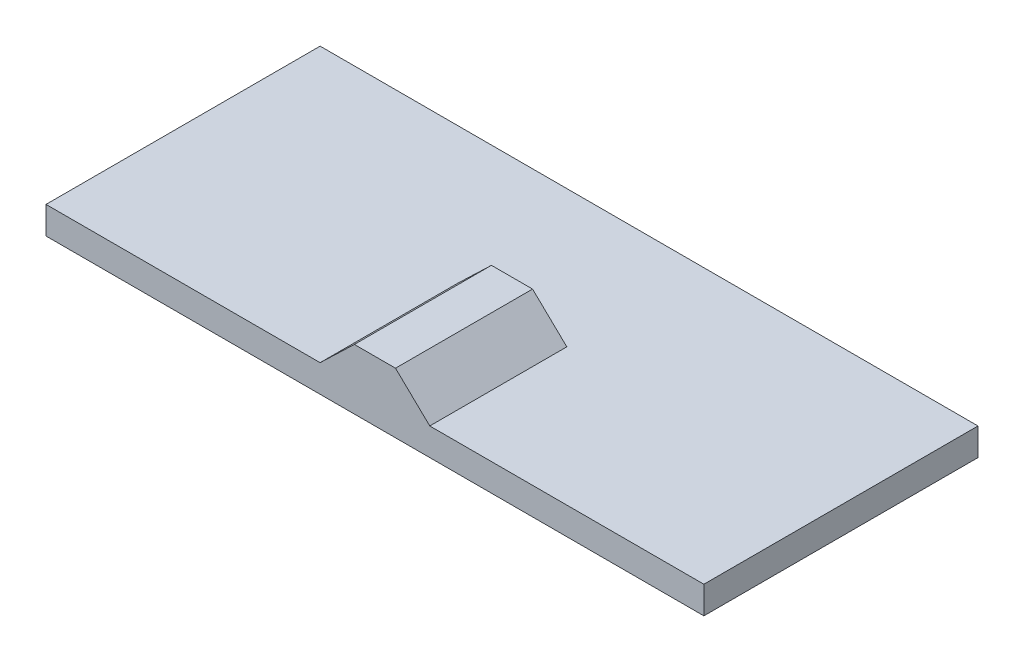
ISO-10303-21;
HEADER;
FILE_DESCRIPTION(('STEP AP214'),'2;1');
FILE_NAME('part.step','',(''),(''),'','','');
FILE_SCHEMA(('AUTOMOTIVE_DESIGN { 1 0 10303 214 1 1 1 1 }'));
ENDSEC;
DATA;
#1=APPLICATION_CONTEXT('core data for automotive mechanical design processes');
#2=APPLICATION_PROTOCOL_DEFINITION('international standard','automotive_design',2000,#1);
#3=PRODUCT_CONTEXT('',#1,'mechanical');
#4=PRODUCT('Part','Part','',(#3));
#5=PRODUCT_RELATED_PRODUCT_CATEGORY('part','',(#4));
#6=PRODUCT_DEFINITION_FORMATION('','',#4);
#7=PRODUCT_DEFINITION_CONTEXT('part definition',#1,'design');
#8=PRODUCT_DEFINITION('design','',#6,#7);
#9=PRODUCT_DEFINITION_SHAPE('','',#8);
#10=(LENGTH_UNIT() NAMED_UNIT(*) SI_UNIT(.MILLI.,.METRE.));
#11=(NAMED_UNIT(*) PLANE_ANGLE_UNIT() SI_UNIT($,.RADIAN.));
#12=(NAMED_UNIT(*) SI_UNIT($,.STERADIAN.) SOLID_ANGLE_UNIT());
#13=UNCERTAINTY_MEASURE_WITH_UNIT(LENGTH_MEASURE(1.E-05),#10,'distance_accuracy_value','');
#14=(GEOMETRIC_REPRESENTATION_CONTEXT(3) GLOBAL_UNCERTAINTY_ASSIGNED_CONTEXT((#13)) GLOBAL_UNIT_ASSIGNED_CONTEXT((#10,
#11,#12)) REPRESENTATION_CONTEXT('',''));
#15=CARTESIAN_POINT('',(0.,0.,0.));
#16=DIRECTION('',(0.,0.,1.));
#17=DIRECTION('',(1.,0.,0.));
#18=AXIS2_PLACEMENT_3D('',#15,#16,#17);
#19=CARTESIAN_POINT('',(-1800.,150.,750.));
#20=DIRECTION('',(1.,0.,0.));
#21=DIRECTION('',(0.,0.,-1.));
#22=AXIS2_PLACEMENT_3D('',#19,#20,#21);
#23=PLANE('',#22);
#24=DIRECTION('',(0.,0.,1.));
#25=VECTOR('',#24,1.);
#26=CARTESIAN_POINT('',(-1800.,0.,750.));
#27=LINE('',#26,#25);
#28=CARTESIAN_POINT('',(-1800.,0.,-750.));
#29=VERTEX_POINT('',#28);
#30=CARTESIAN_POINT('',(-1800.,0.,750.));
#31=VERTEX_POINT('',#30);
#32=EDGE_CURVE('E158',#29,#31,#27,.T.);
#33=ORIENTED_EDGE('',*,*,#32,.T.);
#34=DIRECTION('',(0.,-1.,0.));
#35=VECTOR('',#34,1.);
#36=CARTESIAN_POINT('',(-1800.,150.,750.));
#37=LINE('',#36,#35);
#38=CARTESIAN_POINT('',(-1800.,150.,750.));
#39=VERTEX_POINT('',#38);
#40=EDGE_CURVE('E11',#39,#31,#37,.T.);
#41=ORIENTED_EDGE('',*,*,#40,.F.);
#42=DIRECTION('',(0.,0.,1.));
#43=VECTOR('',#42,1.);
#44=CARTESIAN_POINT('',(-1800.,150.,750.));
#45=LINE('',#44,#43);
#46=CARTESIAN_POINT('',(-1800.,150.,-750.));
#47=VERTEX_POINT('',#46);
#48=EDGE_CURVE('E146',#47,#39,#45,.T.);
#49=ORIENTED_EDGE('',*,*,#48,.F.);
#50=DIRECTION('',(0.,-1.,0.));
#51=VECTOR('',#50,1.);
#52=CARTESIAN_POINT('',(-1800.,150.,-750.));
#53=LINE('',#52,#51);
#54=EDGE_CURVE('E157',#47,#29,#53,.T.);
#55=ORIENTED_EDGE('',*,*,#54,.T.);
#56=EDGE_LOOP('',(#33,#41,#49,#55));
#57=FACE_BOUND('',#56,.T.);
#58=ADVANCED_FACE('F39',(#57),#23,.F.);
#59=CARTESIAN_POINT('',(1800.,150.,750.));
#60=DIRECTION('',(0.,0.,-1.));
#61=DIRECTION('',(-1.,0.,0.));
#62=AXIS2_PLACEMENT_3D('',#59,#60,#61);
#63=PLANE('',#62);
#64=DIRECTION('',(1.,0.,0.));
#65=VECTOR('',#64,1.);
#66=CARTESIAN_POINT('',(1800.,0.,750.));
#67=LINE('',#66,#65);
#68=CARTESIAN_POINT('',(1800.,0.,750.));
#69=VERTEX_POINT('',#68);
#70=EDGE_CURVE('E162',#31,#69,#67,.T.);
#71=ORIENTED_EDGE('',*,*,#70,.T.);
#72=DIRECTION('',(0.,-1.,0.));
#73=VECTOR('',#72,1.);
#74=CARTESIAN_POINT('',(1800.,150.,750.));
#75=LINE('',#74,#73);
#76=CARTESIAN_POINT('',(1800.,150.,750.));
#77=VERTEX_POINT('',#76);
#78=EDGE_CURVE('E47',#77,#69,#75,.T.);
#79=ORIENTED_EDGE('',*,*,#78,.F.);
#80=DIRECTION('',(1.,0.,0.));
#81=VECTOR('',#80,1.);
#82=CARTESIAN_POINT('',(1800.,150.,750.));
#83=LINE('',#82,#81);
#84=CARTESIAN_POINT('',(300.,150.,750.));
#85=VERTEX_POINT('',#84);
#86=EDGE_CURVE('E149',#85,#77,#83,.T.);
#87=ORIENTED_EDGE('',*,*,#86,.F.);
#88=DIRECTION('',(-0.721387321030952,0.692531828189714,0.));
#89=VECTOR('',#88,1.);
#90=CARTESIAN_POINT('',(112.5,330.,750.));
#91=LINE('',#90,#89);
#92=CARTESIAN_POINT('',(112.5,330.,750.));
#93=VERTEX_POINT('',#92);
#94=EDGE_CURVE('E54',#85,#93,#91,.T.);
#95=ORIENTED_EDGE('',*,*,#94,.T.);
#96=DIRECTION('',(-1.,0.,0.));
#97=VECTOR('',#96,1.);
#98=CARTESIAN_POINT('',(-112.5,330.,750.));
#99=LINE('',#98,#97);
#100=CARTESIAN_POINT('',(-112.5,330.,750.));
#101=VERTEX_POINT('',#100);
#102=EDGE_CURVE('E132',#93,#101,#99,.T.);
#103=ORIENTED_EDGE('',*,*,#102,.T.);
#104=DIRECTION('',(-0.721387321030952,-0.692531828189713,0.));
#105=VECTOR('',#104,1.);
#106=CARTESIAN_POINT('',(-300.,150.,750.));
#107=LINE('',#106,#105);
#108=CARTESIAN_POINT('',(-300.,150.,750.));
#109=VERTEX_POINT('',#108);
#110=EDGE_CURVE('E277',#101,#109,#107,.T.);
#111=ORIENTED_EDGE('',*,*,#110,.T.);
#112=EDGE_CURVE('E91',#39,#109,#83,.T.);
#113=ORIENTED_EDGE('',*,*,#112,.F.);
#114=ORIENTED_EDGE('',*,*,#40,.T.);
#115=EDGE_LOOP('',(#71,#79,#87,#95,#103,#111,#113,#114));
#116=FACE_BOUND('',#115,.T.);
#117=ADVANCED_FACE('F197',(#116),#63,.F.);
#118=CARTESIAN_POINT('',(1800.,150.,750.));
#119=DIRECTION('',(-1.,0.,0.));
#120=DIRECTION('',(0.,0.,1.));
#121=AXIS2_PLACEMENT_3D('',#118,#119,#120);
#122=PLANE('',#121);
#123=DIRECTION('',(0.,0.,-1.));
#124=VECTOR('',#123,1.);
#125=CARTESIAN_POINT('',(1800.,0.,750.));
#126=LINE('',#125,#124);
#127=CARTESIAN_POINT('',(1800.,0.,-750.));
#128=VERTEX_POINT('',#127);
#129=EDGE_CURVE('E165',#69,#128,#126,.T.);
#130=ORIENTED_EDGE('',*,*,#129,.T.);
#131=DIRECTION('',(0.,-1.,0.));
#132=VECTOR('',#131,1.);
#133=CARTESIAN_POINT('',(1800.,150.,-750.));
#134=LINE('',#133,#132);
#135=CARTESIAN_POINT('',(1800.,150.,-750.));
#136=VERTEX_POINT('',#135);
#137=EDGE_CURVE('E172',#136,#128,#134,.T.);
#138=ORIENTED_EDGE('',*,*,#137,.F.);
#139=DIRECTION('',(0.,0.,-1.));
#140=VECTOR('',#139,1.);
#141=CARTESIAN_POINT('',(1800.,150.,750.));
#142=LINE('',#141,#140);
#143=EDGE_CURVE('E152',#77,#136,#142,.T.);
#144=ORIENTED_EDGE('',*,*,#143,.F.);
#145=ORIENTED_EDGE('',*,*,#78,.T.);
#146=EDGE_LOOP('',(#130,#138,#144,#145));
#147=FACE_BOUND('',#146,.T.);
#148=ADVANCED_FACE('F180',(#147),#122,.F.);
#149=CARTESIAN_POINT('',(1800.,150.,-750.));
#150=DIRECTION('',(0.,0.,1.));
#151=DIRECTION('',(1.,0.,0.));
#152=AXIS2_PLACEMENT_3D('',#149,#150,#151);
#153=PLANE('',#152);
#154=DIRECTION('',(-1.,0.,0.));
#155=VECTOR('',#154,1.);
#156=CARTESIAN_POINT('',(1800.,0.,-750.));
#157=LINE('',#156,#155);
#158=EDGE_CURVE('E84',#128,#29,#157,.T.);
#159=ORIENTED_EDGE('',*,*,#158,.T.);
#160=ORIENTED_EDGE('',*,*,#54,.F.);
#161=DIRECTION('',(-1.,0.,0.));
#162=VECTOR('',#161,1.);
#163=CARTESIAN_POINT('',(1800.,150.,-750.));
#164=LINE('',#163,#162);
#165=EDGE_CURVE('E63',#136,#47,#164,.T.);
#166=ORIENTED_EDGE('',*,*,#165,.F.);
#167=ORIENTED_EDGE('',*,*,#137,.T.);
#168=EDGE_LOOP('',(#159,#160,#166,#167));
#169=FACE_BOUND('',#168,.T.);
#170=ADVANCED_FACE('F189',(#169),#153,.F.);
#171=CARTESIAN_POINT('',(0.,150.,0.));
#172=DIRECTION('',(0.,1.,0.));
#173=DIRECTION('',(0.,0.,1.));
#174=AXIS2_PLACEMENT_3D('',#171,#172,#173);
#175=PLANE('',#174);
#176=DIRECTION('',(0.,0.,1.));
#177=VECTOR('',#176,1.);
#178=CARTESIAN_POINT('',(-300.,150.,0.));
#179=LINE('',#178,#177);
#180=CARTESIAN_POINT('',(-300.,150.,0.));
#181=VERTEX_POINT('',#180);
#182=EDGE_CURVE('E129',#181,#109,#179,.T.);
#183=ORIENTED_EDGE('',*,*,#182,.F.);
#184=DIRECTION('',(1.,0.,0.));
#185=VECTOR('',#184,1.);
#186=CARTESIAN_POINT('',(300.,150.,0.));
#187=LINE('',#186,#185);
#188=CARTESIAN_POINT('',(300.,150.,0.));
#189=VERTEX_POINT('',#188);
#190=EDGE_CURVE('E115',#181,#189,#187,.T.);
#191=ORIENTED_EDGE('',*,*,#190,.T.);
#192=DIRECTION('',(0.,0.,1.));
#193=VECTOR('',#192,1.);
#194=CARTESIAN_POINT('',(300.,150.,0.));
#195=LINE('',#194,#193);
#196=EDGE_CURVE('E136',#189,#85,#195,.T.);
#197=ORIENTED_EDGE('',*,*,#196,.T.);
#198=ORIENTED_EDGE('',*,*,#86,.T.);
#199=ORIENTED_EDGE('',*,*,#143,.T.);
#200=ORIENTED_EDGE('',*,*,#165,.T.);
#201=ORIENTED_EDGE('',*,*,#48,.T.);
#202=ORIENTED_EDGE('',*,*,#112,.T.);
#203=EDGE_LOOP('',(#183,#191,#197,#198,#199,#200,#201,#202));
#204=FACE_BOUND('',#203,.T.);
#205=ADVANCED_FACE('F134',(#204),#175,.T.);
#206=CARTESIAN_POINT('',(0.,0.,0.));
#207=DIRECTION('',(0.,1.,0.));
#208=DIRECTION('',(0.,0.,1.));
#209=AXIS2_PLACEMENT_3D('',#206,#207,#208);
#210=PLANE('',#209);
#211=ORIENTED_EDGE('',*,*,#32,.F.);
#212=ORIENTED_EDGE('',*,*,#158,.F.);
#213=ORIENTED_EDGE('',*,*,#129,.F.);
#214=ORIENTED_EDGE('',*,*,#70,.F.);
#215=EDGE_LOOP('',(#211,#212,#213,#214));
#216=FACE_BOUND('',#215,.T.);
#217=ADVANCED_FACE('F185',(#216),#210,.F.);
#218=CARTESIAN_POINT('',(-300.,150.,0.));
#219=DIRECTION('',(-0.692531828189713,0.721387321030952,0.));
#220=DIRECTION('',(-0.721387321030952,-0.692531828189713,0.));
#221=AXIS2_PLACEMENT_3D('',#218,#219,#220);
#222=PLANE('',#221);
#223=ORIENTED_EDGE('',*,*,#110,.F.);
#224=DIRECTION('',(0.,0.,1.));
#225=VECTOR('',#224,1.);
#226=CARTESIAN_POINT('',(-112.5,330.,0.));
#227=LINE('',#226,#225);
#228=CARTESIAN_POINT('',(-112.5,330.,0.));
#229=VERTEX_POINT('',#228);
#230=EDGE_CURVE('E130',#229,#101,#227,.T.);
#231=ORIENTED_EDGE('',*,*,#230,.F.);
#232=DIRECTION('',(-0.721387321030952,-0.692531828189713,0.));
#233=VECTOR('',#232,1.);
#234=CARTESIAN_POINT('',(-300.,150.,0.));
#235=LINE('',#234,#233);
#236=EDGE_CURVE('E119',#229,#181,#235,.T.);
#237=ORIENTED_EDGE('',*,*,#236,.T.);
#238=ORIENTED_EDGE('',*,*,#182,.T.);
#239=EDGE_LOOP('',(#223,#231,#237,#238));
#240=FACE_BOUND('',#239,.T.);
#241=ADVANCED_FACE('F128',(#240),#222,.T.);
#242=CARTESIAN_POINT('',(-112.5,330.,0.));
#243=DIRECTION('',(0.,1.,0.));
#244=DIRECTION('',(0.,0.,1.));
#245=AXIS2_PLACEMENT_3D('',#242,#243,#244);
#246=PLANE('',#245);
#247=ORIENTED_EDGE('',*,*,#102,.F.);
#248=DIRECTION('',(0.,0.,1.));
#249=VECTOR('',#248,1.);
#250=CARTESIAN_POINT('',(112.5,330.,0.));
#251=LINE('',#250,#249);
#252=CARTESIAN_POINT('',(112.5,330.,0.));
#253=VERTEX_POINT('',#252);
#254=EDGE_CURVE('E141',#253,#93,#251,.T.);
#255=ORIENTED_EDGE('',*,*,#254,.F.);
#256=DIRECTION('',(-1.,0.,0.));
#257=VECTOR('',#256,1.);
#258=CARTESIAN_POINT('',(-112.5,330.,0.));
#259=LINE('',#258,#257);
#260=EDGE_CURVE('E137',#253,#229,#259,.T.);
#261=ORIENTED_EDGE('',*,*,#260,.T.);
#262=ORIENTED_EDGE('',*,*,#230,.T.);
#263=EDGE_LOOP('',(#247,#255,#261,#262));
#264=FACE_BOUND('',#263,.T.);
#265=ADVANCED_FACE('F235',(#264),#246,.T.);
#266=CARTESIAN_POINT('',(112.5,330.,0.));
#267=DIRECTION('',(0.692531828189713,0.721387321030951,0.));
#268=DIRECTION('',(-0.721387321030952,0.692531828189714,0.));
#269=AXIS2_PLACEMENT_3D('',#266,#267,#268);
#270=PLANE('',#269);
#271=ORIENTED_EDGE('',*,*,#94,.F.);
#272=ORIENTED_EDGE('',*,*,#196,.F.);
#273=DIRECTION('',(-0.721387321030952,0.692531828189714,0.));
#274=VECTOR('',#273,1.);
#275=CARTESIAN_POINT('',(112.5,330.,0.));
#276=LINE('',#275,#274);
#277=EDGE_CURVE('E122',#189,#253,#276,.T.);
#278=ORIENTED_EDGE('',*,*,#277,.T.);
#279=ORIENTED_EDGE('',*,*,#254,.T.);
#280=EDGE_LOOP('',(#271,#272,#278,#279));
#281=FACE_BOUND('',#280,.T.);
#282=ADVANCED_FACE('F242',(#281),#270,.T.);
#283=CARTESIAN_POINT('',(0.,0.,0.));
#284=DIRECTION('',(0.,0.,-1.));
#285=DIRECTION('',(-1.,0.,0.));
#286=AXIS2_PLACEMENT_3D('',#283,#284,#285);
#287=PLANE('',#286);
#288=ORIENTED_EDGE('',*,*,#236,.F.);
#289=ORIENTED_EDGE('',*,*,#260,.F.);
#290=ORIENTED_EDGE('',*,*,#277,.F.);
#291=ORIENTED_EDGE('',*,*,#190,.F.);
#292=EDGE_LOOP('',(#288,#289,#290,#291));
#293=FACE_BOUND('',#292,.T.);
#294=ADVANCED_FACE('F117',(#293),#287,.T.);
#295=CLOSED_SHELL('',(#58,#117,#148,#170,#205,#217,#241,#265,#282,#294));
#296=MANIFOLD_SOLID_BREP('B2',#295);
#297=ADVANCED_BREP_SHAPE_REPRESENTATION('',(#18,#296),#14);
#298=SHAPE_DEFINITION_REPRESENTATION(#9,#297);
ENDSEC;
END-ISO-10303-21;
